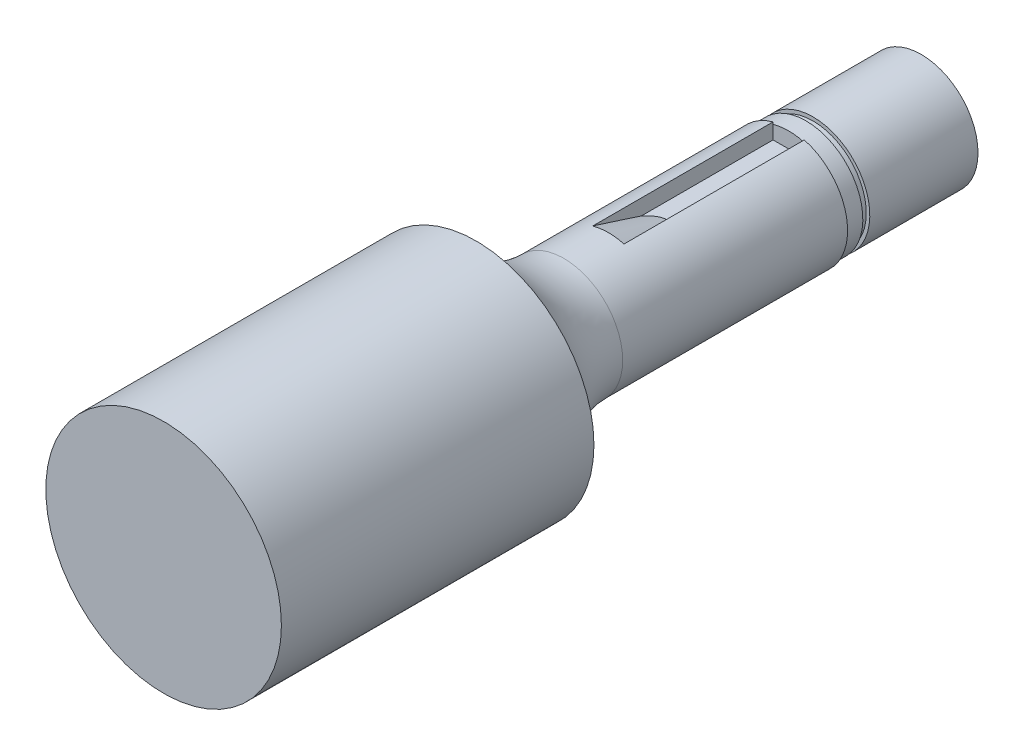
ISO-10303-21;
HEADER;
FILE_DESCRIPTION(('STEP AP214'),'2;1');
FILE_NAME('part.step','',(''),(''),'','','');
FILE_SCHEMA(('AUTOMOTIVE_DESIGN { 1 0 10303 214 1 1 1 1 }'));
ENDSEC;
DATA;
#1=APPLICATION_CONTEXT('core data for automotive mechanical design processes');
#2=APPLICATION_PROTOCOL_DEFINITION('international standard','automotive_design',2000,#1);
#3=PRODUCT_CONTEXT('',#1,'mechanical');
#4=PRODUCT('Part','Part','',(#3));
#5=PRODUCT_RELATED_PRODUCT_CATEGORY('part','',(#4));
#6=PRODUCT_DEFINITION_FORMATION('','',#4);
#7=PRODUCT_DEFINITION_CONTEXT('part definition',#1,'design');
#8=PRODUCT_DEFINITION('design','',#6,#7);
#9=PRODUCT_DEFINITION_SHAPE('','',#8);
#10=(LENGTH_UNIT() NAMED_UNIT(*) SI_UNIT(.MILLI.,.METRE.));
#11=(NAMED_UNIT(*) PLANE_ANGLE_UNIT() SI_UNIT($,.RADIAN.));
#12=(NAMED_UNIT(*) SI_UNIT($,.STERADIAN.) SOLID_ANGLE_UNIT());
#13=UNCERTAINTY_MEASURE_WITH_UNIT(LENGTH_MEASURE(1.E-05),#10,'distance_accuracy_value','');
#14=(GEOMETRIC_REPRESENTATION_CONTEXT(3) GLOBAL_UNCERTAINTY_ASSIGNED_CONTEXT((#13)) GLOBAL_UNIT_ASSIGNED_CONTEXT((#10,
#11,#12)) REPRESENTATION_CONTEXT('',''));
#15=CARTESIAN_POINT('',(0.,0.,0.));
#16=DIRECTION('',(0.,0.,1.));
#17=DIRECTION('',(1.,0.,0.));
#18=AXIS2_PLACEMENT_3D('',#15,#16,#17);
#19=CARTESIAN_POINT('',(0.,0.,33.02));
#20=DIRECTION('',(0.,0.,-1.));
#21=DIRECTION('',(-1.,0.,0.));
#22=AXIS2_PLACEMENT_3D('',#19,#20,#21);
#23=CYLINDRICAL_SURFACE('',#22,6.223);
#24=CARTESIAN_POINT('',(0.,0.,23.7607197363942));
#25=DIRECTION('',(0.,0.,1.));
#26=DIRECTION('',(1.,0.,0.));
#27=AXIS2_PLACEMENT_3D('',#24,#25,#26);
#28=CIRCLE('',#27,6.223);
#29=CARTESIAN_POINT('',(6.223,0.,23.7607197363942));
#30=VERTEX_POINT('',#29);
#31=EDGE_CURVE('E11',#30,#30,#28,.F.);
#32=ORIENTED_EDGE('',*,*,#31,.T.);
#33=EDGE_LOOP('',(#32));
#34=FACE_BOUND('',#33,.T.);
#35=DIRECTION('',(0.,0.,-1.));
#36=VECTOR('',#35,1.);
#37=CARTESIAN_POINT('',(1.651,5.999993999997,33.02));
#38=LINE('',#37,#36);
#39=CARTESIAN_POINT('',(1.651,5.999993999997,0.));
#40=VERTEX_POINT('',#39);
#41=CARTESIAN_POINT('',(1.651,5.999993999997,19.05));
#42=VERTEX_POINT('',#41);
#43=EDGE_CURVE('E119',#40,#42,#38,.F.);
#44=ORIENTED_EDGE('',*,*,#43,.T.);
#45=CARTESIAN_POINT('',(0.,0.,19.05));
#46=DIRECTION('',(0.,0.,-1.));
#47=DIRECTION('',(-1.,0.,0.));
#48=AXIS2_PLACEMENT_3D('',#45,#46,#47);
#49=CIRCLE('',#48,6.223);
#50=CARTESIAN_POINT('',(-1.651,5.999993999997,19.05));
#51=VERTEX_POINT('',#50);
#52=EDGE_CURVE('E94',#42,#51,#49,.F.);
#53=ORIENTED_EDGE('',*,*,#52,.T.);
#54=DIRECTION('',(0.,0.,-1.));
#55=VECTOR('',#54,1.);
#56=CARTESIAN_POINT('',(-1.651,5.999993999997,33.02));
#57=LINE('',#56,#55);
#58=CARTESIAN_POINT('',(-1.651,5.999993999997,0.));
#59=VERTEX_POINT('',#58);
#60=EDGE_CURVE('E116',#51,#59,#57,.T.);
#61=ORIENTED_EDGE('',*,*,#60,.T.);
#62=CARTESIAN_POINT('',(0.,0.,0.));
#63=DIRECTION('',(0.,0.,1.));
#64=DIRECTION('',(1.,0.,0.));
#65=AXIS2_PLACEMENT_3D('',#62,#63,#64);
#66=CIRCLE('',#65,6.223);
#67=EDGE_CURVE('E95',#59,#40,#66,.T.);
#68=ORIENTED_EDGE('',*,*,#67,.T.);
#69=EDGE_LOOP('',(#44,#53,#61,#68));
#70=FACE_BOUND('',#69,.T.);
#71=ADVANCED_FACE('F35',(#34,#70),#23,.T.);
#72=CARTESIAN_POINT('',(0.,0.,0.));
#73=DIRECTION('',(0.,0.,1.));
#74=DIRECTION('',(1.,0.,0.));
#75=AXIS2_PLACEMENT_3D('',#72,#73,#74);
#76=PLANE('',#75);
#77=DIRECTION('',(0.,1.,0.));
#78=VECTOR('',#77,1.);
#79=CARTESIAN_POINT('',(-1.651,7.650993999997,0.));
#80=LINE('',#79,#78);
#81=CARTESIAN_POINT('',(-1.651,5.76837923510582,0.));
#82=VERTEX_POINT('',#81);
#83=EDGE_CURVE('E104',#82,#59,#80,.T.);
#84=ORIENTED_EDGE('',*,*,#83,.F.);
#85=CARTESIAN_POINT('',(0.,0.,0.));
#86=DIRECTION('',(0.,0.,1.));
#87=DIRECTION('',(0.124481116014532,-0.992221977057441,0.));
#88=AXIS2_PLACEMENT_3D('',#85,#86,#87);
#89=CIRCLE('',#88,6.);
#90=CARTESIAN_POINT('',(1.651,5.76837923510582,0.));
#91=VERTEX_POINT('',#90);
#92=EDGE_CURVE('E84',#82,#91,#89,.T.);
#93=ORIENTED_EDGE('',*,*,#92,.T.);
#94=DIRECTION('',(0.,-1.,0.));
#95=VECTOR('',#94,1.);
#96=CARTESIAN_POINT('',(1.651,7.650993999997,0.));
#97=LINE('',#96,#95);
#98=EDGE_CURVE('E200',#40,#91,#97,.T.);
#99=ORIENTED_EDGE('',*,*,#98,.F.);
#100=ORIENTED_EDGE('',*,*,#67,.F.);
#101=EDGE_LOOP('',(#84,#93,#99,#100));
#102=FACE_BOUND('',#101,.T.);
#103=ADVANCED_FACE('F105',(#102),#76,.F.);
#104=CARTESIAN_POINT('',(0.,0.,66.04));
#105=DIRECTION('',(0.,0.,-1.));
#106=DIRECTION('',(-1.,0.,0.));
#107=AXIS2_PLACEMENT_3D('',#104,#105,#106);
#108=CYLINDRICAL_SURFACE('',#107,12.446);
#109=CARTESIAN_POINT('',(0.,0.,66.04));
#110=DIRECTION('',(0.,0.,1.));
#111=DIRECTION('',(1.,0.,0.));
#112=AXIS2_PLACEMENT_3D('',#109,#110,#111);
#113=CIRCLE('',#112,12.446);
#114=CARTESIAN_POINT('',(12.446,0.,66.04));
#115=VERTEX_POINT('',#114);
#116=EDGE_CURVE('E122',#115,#115,#113,.T.);
#117=ORIENTED_EDGE('',*,*,#116,.F.);
#118=EDGE_LOOP('',(#117));
#119=FACE_BOUND('',#118,.T.);
#120=CARTESIAN_POINT('',(0.,0.,33.02));
#121=DIRECTION('',(0.,0.,1.));
#122=DIRECTION('',(1.,0.,0.));
#123=AXIS2_PLACEMENT_3D('',#120,#121,#122);
#124=CIRCLE('',#123,12.446);
#125=CARTESIAN_POINT('',(12.446,0.,33.02));
#126=VERTEX_POINT('',#125);
#127=EDGE_CURVE('E121',#126,#126,#124,.T.);
#128=ORIENTED_EDGE('',*,*,#127,.T.);
#129=EDGE_LOOP('',(#128));
#130=FACE_BOUND('',#129,.T.);
#131=ADVANCED_FACE('F193',(#119,#130),#108,.T.);
#132=CARTESIAN_POINT('',(1.651,7.650993999997,12.7));
#133=DIRECTION('',(1.,0.,0.));
#134=DIRECTION('',(0.,0.,-1.));
#135=AXIS2_PLACEMENT_3D('',#132,#133,#134);
#136=PLANE('',#135);
#137=ORIENTED_EDGE('',*,*,#98,.T.);
#138=CARTESIAN_POINT('',(1.651,4.348993999997,0.));
#139=VERTEX_POINT('',#138);
#140=EDGE_CURVE('E101',#91,#139,#97,.T.);
#141=ORIENTED_EDGE('',*,*,#140,.T.);
#142=DIRECTION('',(0.,0.,-1.));
#143=VECTOR('',#142,1.);
#144=CARTESIAN_POINT('',(1.651,4.348993999997,12.7));
#145=LINE('',#144,#143);
#146=CARTESIAN_POINT('',(1.651,4.348993999997,13.9109441465152));
#147=VERTEX_POINT('',#146);
#148=EDGE_CURVE('E58',#147,#139,#145,.T.);
#149=ORIENTED_EDGE('',*,*,#148,.F.);
#150=CARTESIAN_POINT('',(1.651,4.348993999997,13.9109441465152));
#151=CARTESIAN_POINT('',(1.651,4.48878768448812,14.3384861432952));
#152=CARTESIAN_POINT('',(1.651,4.62785328900993,14.7662652337215));
#153=CARTESIAN_POINT('',(1.651,4.90480450015791,15.6222030603465));
#154=CARTESIAN_POINT('',(1.651,5.0426901125231,16.0503617946876));
#155=CARTESIAN_POINT('',(1.651,5.31755858795782,16.906967693413));
#156=CARTESIAN_POINT('',(1.651,5.45454145279133,17.3354148572319));
#157=CARTESIAN_POINT('',(1.651,5.72777481213549,18.1925449818668));
#158=CARTESIAN_POINT('',(1.651,5.86402530310477,18.621227943812));
#159=CARTESIAN_POINT('',(1.651,5.99999399999707,19.05));
#160=B_SPLINE_CURVE_WITH_KNOTS('',3,(#150,#151,#152,#153,#154,#155,#156,#157,#158,#159),
.UNSPECIFIED.,.F.,.F.,(4,2,2,2,4),(0.,1.34944603210449,2.69888549730226,4.04832232487302,
5.39776567172789),.UNSPECIFIED.);
#161=EDGE_CURVE('E137',#147,#42,#160,.T.);
#162=ORIENTED_EDGE('',*,*,#161,.T.);
#163=ORIENTED_EDGE('',*,*,#43,.F.);
#164=EDGE_LOOP('',(#137,#141,#149,#162,#163));
#165=FACE_BOUND('',#164,.T.);
#166=ADVANCED_FACE('F162',(#165),#136,.F.);
#167=CARTESIAN_POINT('',(-1.651,7.650993999997,12.7));
#168=DIRECTION('',(-1.,0.,0.));
#169=DIRECTION('',(0.,-1.,0.));
#170=AXIS2_PLACEMENT_3D('',#167,#168,#169);
#171=PLANE('',#170);
#172=ORIENTED_EDGE('',*,*,#60,.F.);
#173=CARTESIAN_POINT('',(-1.651,5.999993999997,19.05));
#174=CARTESIAN_POINT('',(-1.651,5.86402530310475,18.621227943812));
#175=CARTESIAN_POINT('',(-1.651,5.72777481213549,18.1925449818668));
#176=CARTESIAN_POINT('',(-1.651,5.45454145279134,17.3354148572319));
#177=CARTESIAN_POINT('',(-1.651,5.31755858795782,16.906967693413));
#178=CARTESIAN_POINT('',(-1.651,5.0426901125231,16.0503617946876));
#179=CARTESIAN_POINT('',(-1.651,4.90480450015791,15.6222030603465));
#180=CARTESIAN_POINT('',(-1.651,4.62785328900993,14.7662652337215));
#181=CARTESIAN_POINT('',(-1.651,4.48878768448813,14.3384861432952));
#182=CARTESIAN_POINT('',(-1.651,4.348993999997,13.9109441465152));
#183=B_SPLINE_CURVE_WITH_KNOTS('',3,(#173,#174,#175,#176,#177,#178,#179,#180,#181,#182),
.UNSPECIFIED.,.F.,.F.,(4,2,2,2,4),(0.,1.34944334685487,2.69888017442563,4.04831963962339,
5.39776567172789),.UNSPECIFIED.);
#184=CARTESIAN_POINT('',(-1.651,4.348993999997,13.9109441465152));
#185=VERTEX_POINT('',#184);
#186=EDGE_CURVE('E43',#51,#185,#183,.T.);
#187=ORIENTED_EDGE('',*,*,#186,.T.);
#188=DIRECTION('',(0.,0.,-1.));
#189=VECTOR('',#188,1.);
#190=CARTESIAN_POINT('',(-1.651,4.348993999997,12.7));
#191=LINE('',#190,#189);
#192=CARTESIAN_POINT('',(-1.651,4.348993999997,0.));
#193=VERTEX_POINT('',#192);
#194=EDGE_CURVE('E50',#185,#193,#191,.T.);
#195=ORIENTED_EDGE('',*,*,#194,.T.);
#196=EDGE_CURVE('E100',#193,#82,#80,.T.);
#197=ORIENTED_EDGE('',*,*,#196,.T.);
#198=ORIENTED_EDGE('',*,*,#83,.T.);
#199=EDGE_LOOP('',(#172,#187,#195,#197,#198));
#200=FACE_BOUND('',#199,.T.);
#201=ADVANCED_FACE('F111',(#200),#171,.F.);
#202=CARTESIAN_POINT('',(1.651,4.348993999997,12.7));
#203=DIRECTION('',(0.,-1.,0.));
#204=DIRECTION('',(1.,0.,0.));
#205=AXIS2_PLACEMENT_3D('',#202,#203,#204);
#206=PLANE('',#205);
#207=DIRECTION('',(-1.,0.,0.));
#208=VECTOR('',#207,1.);
#209=CARTESIAN_POINT('',(1.651,4.348993999997,0.));
#210=LINE('',#209,#208);
#211=EDGE_CURVE('E109',#139,#193,#210,.T.);
#212=ORIENTED_EDGE('',*,*,#211,.T.);
#213=ORIENTED_EDGE('',*,*,#194,.F.);
#214=CARTESIAN_POINT('',(-1.651,4.348993999997,13.9109441465152));
#215=CARTESIAN_POINT('',(-1.61005618872781,4.348993999997,13.8634272974747));
#216=CARTESIAN_POINT('',(-1.56836410959487,4.348993999997,13.8165582887386));
#217=CARTESIAN_POINT('',(-1.48322673799133,4.348993999997,13.7243626394037));
#218=CARTESIAN_POINT('',(-1.43977984637753,4.348993999997,13.6790374783294));
#219=CARTESIAN_POINT('',(-1.30452629215187,4.348993999997,13.543870052739));
#220=CARTESIAN_POINT('',(-1.20964096979234,4.348993999997,13.4570180673232));
#221=CARTESIAN_POINT('',(-1.00927266923083,4.348993999997,13.2949445900507));
#222=CARTESIAN_POINT('',(-0.903730972190333,4.348993999997,13.2197940685727));
#223=CARTESIAN_POINT('',(-0.681503187742133,4.348993999997,13.0896475755019));
#224=CARTESIAN_POINT('',(-0.564931867247685,4.348993999997,13.0344678156366));
#225=CARTESIAN_POINT('',(-0.369229233683072,4.348993999997,12.9695338077975));
#226=CARTESIAN_POINT('',(-0.293220374053448,4.348993999997,12.95045673981));
#227=CARTESIAN_POINT('',(-0.139043205256273,4.348993999997,12.9254592434777));
#228=CARTESIAN_POINT('',(-0.0608778557482803,4.348993999997,12.9195216107734));
#229=CARTESIAN_POINT('',(0.0517782545083004,4.348993999997,12.9209532088466));
#230=CARTESIAN_POINT('',(0.0864128917035788,4.348993999997,12.922763167982));
#231=CARTESIAN_POINT('',(0.155419094372631,4.348993999997,12.9290359683526));
#232=CARTESIAN_POINT('',(0.189790805941623,4.348993999997,12.9334972085648));
#233=CARTESIAN_POINT('',(0.325453308823906,4.348993999997,12.9563450626101));
#234=CARTESIAN_POINT('',(0.425161260717606,4.348993999997,12.9848499555557));
#235=CARTESIAN_POINT('',(0.617795877622099,4.348993999997,13.0597493757885));
#236=CARTESIAN_POINT('',(0.710680653530877,4.348993999997,13.1062449395608));
#237=CARTESIAN_POINT('',(0.937966610244844,4.348993999997,13.2406669883374));
#238=CARTESIAN_POINT('',(1.06709253530649,4.348993999997,13.3373137076738));
#239=CARTESIAN_POINT('',(1.31046762868501,4.348993999997,13.547204462987));
#240=CARTESIAN_POINT('',(1.42469917345692,4.348993999997,13.6604678297207));
#241=CARTESIAN_POINT('',(1.55336440303727,4.348993999997,13.8004306161889));
#242=CARTESIAN_POINT('',(1.57316875795473,4.348993999997,13.8223461472048));
#243=CARTESIAN_POINT('',(1.61237096339529,4.348993999997,13.8664398477914));
#244=CARTESIAN_POINT('',(1.6317697068805,4.348993999997,13.8886172232144));
#245=CARTESIAN_POINT('',(1.65100000000007,4.348993999997,13.9109441465152));
#246=B_SPLINE_CURVE_WITH_KNOTS('',3,(#214,#215,#216,#217,#218,#219,#220,#221,#222,#223,#224,
#225,#226,#227,#228,#229,#230,#231,#232,#233,#234,#235,#236,#237,#238,#239,#240,#241,#242,#243,
#244,#245),.UNSPECIFIED.,.F.,.F.,(4,2,2,2,2,2,2,2,2,2,2,2,2,2,2,4),(0.,0.188151120985542,
0.376477751888457,0.761659868508651,1.14909407303352,1.53286621972931,1.76701346073699,
2.00085393492138,2.10481187527057,2.20870710246953,2.5173066354491,2.82766503982231,
3.30878007454317,3.79045931270973,3.87907370203482,3.9674664175143),.UNSPECIFIED.);
#247=EDGE_CURVE('E130',#185,#147,#246,.T.);
#248=ORIENTED_EDGE('',*,*,#247,.T.);
#249=ORIENTED_EDGE('',*,*,#148,.T.);
#250=EDGE_LOOP('',(#212,#213,#248,#249));
#251=FACE_BOUND('',#250,.T.);
#252=ADVANCED_FACE('F143',(#251),#206,.F.);
#253=CARTESIAN_POINT('',(0.,0.,0.));
#254=DIRECTION('',(0.,0.,1.));
#255=DIRECTION('',(0.124481116014532,-0.992221977057441,0.));
#256=AXIS2_PLACEMENT_3D('',#253,#254,#255);
#257=PLANE('',#256);
#258=ORIENTED_EDGE('',*,*,#140,.F.);
#259=EDGE_CURVE('E88',#91,#82,#89,.T.);
#260=ORIENTED_EDGE('',*,*,#259,.T.);
#261=ORIENTED_EDGE('',*,*,#196,.F.);
#262=ORIENTED_EDGE('',*,*,#211,.F.);
#263=EDGE_LOOP('',(#258,#260,#261,#262));
#264=FACE_BOUND('',#263,.T.);
#265=ADVANCED_FACE('F98',(#264),#257,.T.);
#266=CARTESIAN_POINT('',(0.,0.,0.));
#267=DIRECTION('',(0.,0.,-1.));
#268=DIRECTION('',(-0.124481116014532,0.992221977057441,0.));
#269=AXIS2_PLACEMENT_3D('',#266,#267,#268);
#270=CYLINDRICAL_SURFACE('',#269,6.);
#271=ORIENTED_EDGE('',*,*,#259,.F.);
#272=ORIENTED_EDGE('',*,*,#92,.F.);
#273=EDGE_LOOP('',(#271,#272));
#274=FACE_BOUND('',#273,.T.);
#275=CARTESIAN_POINT('',(0.,0.,-1.8334));
#276=DIRECTION('',(0.,0.,-1.));
#277=DIRECTION('',(-0.124481116014532,0.992221977057441,0.));
#278=AXIS2_PLACEMENT_3D('',#275,#276,#277);
#279=CIRCLE('',#278,6.);
#280=CARTESIAN_POINT('',(-0.746886696087194,5.95333186234465,-1.8334));
#281=VERTEX_POINT('',#280);
#282=EDGE_CURVE('E202',#281,#281,#279,.T.);
#283=ORIENTED_EDGE('',*,*,#282,.F.);
#284=EDGE_LOOP('',(#283));
#285=FACE_BOUND('',#284,.T.);
#286=ADVANCED_FACE('F86',(#274,#285),#270,.T.);
#287=CARTESIAN_POINT('',(0.,0.,-1.8334));
#288=DIRECTION('',(0.,0.,-1.));
#289=DIRECTION('',(-0.124481116014532,0.992221977057441,0.));
#290=AXIS2_PLACEMENT_3D('',#287,#288,#289);
#291=PLANE('',#290);
#292=CARTESIAN_POINT('',(0.,0.,-1.8334));
#293=DIRECTION('',(0.,0.,-1.));
#294=DIRECTION('',(-0.124481116014532,0.992221977057441,0.));
#295=AXIS2_PLACEMENT_3D('',#292,#293,#294);
#296=CIRCLE('',#295,5.6261);
#297=CARTESIAN_POINT('',(-0.700343206809361,5.58234006512287,-1.8334));
#298=VERTEX_POINT('',#297);
#299=EDGE_CURVE('E208',#298,#298,#296,.T.);
#300=ORIENTED_EDGE('',*,*,#299,.F.);
#301=EDGE_LOOP('',(#300));
#302=FACE_BOUND('',#301,.T.);
#303=ORIENTED_EDGE('',*,*,#282,.T.);
#304=EDGE_LOOP('',(#303));
#305=FACE_BOUND('',#304,.T.);
#306=ADVANCED_FACE('F176',(#302,#305),#291,.T.);
#307=CARTESIAN_POINT('',(0.,0.,-2.57));
#308=DIRECTION('',(0.,0.,-1.));
#309=DIRECTION('',(-0.124481116014532,0.992221977057441,0.));
#310=AXIS2_PLACEMENT_3D('',#307,#308,#309);
#311=PLANE('',#310);
#312=CARTESIAN_POINT('',(0.,0.,-2.57));
#313=DIRECTION('',(0.,0.,-1.));
#314=DIRECTION('',(-0.124481116014532,0.992221977057441,0.));
#315=AXIS2_PLACEMENT_3D('',#312,#313,#314);
#316=CIRCLE('',#315,5.6261);
#317=CARTESIAN_POINT('',(-0.700343206809361,5.58234006512287,-2.57));
#318=VERTEX_POINT('',#317);
#319=EDGE_CURVE('E211',#318,#318,#316,.T.);
#320=ORIENTED_EDGE('',*,*,#319,.T.);
#321=EDGE_LOOP('',(#320));
#322=FACE_BOUND('',#321,.T.);
#323=CARTESIAN_POINT('',(0.,0.,-2.57));
#324=DIRECTION('',(0.,0.,-1.));
#325=DIRECTION('',(-0.124481116014532,0.992221977057441,0.));
#326=AXIS2_PLACEMENT_3D('',#323,#324,#325);
#327=CIRCLE('',#326,6.);
#328=CARTESIAN_POINT('',(-0.746886696087194,5.95333186234465,-2.57));
#329=VERTEX_POINT('',#328);
#330=EDGE_CURVE('E205',#329,#329,#327,.T.);
#331=ORIENTED_EDGE('',*,*,#330,.F.);
#332=EDGE_LOOP('',(#331));
#333=FACE_BOUND('',#332,.T.);
#334=ADVANCED_FACE('F173',(#322,#333),#311,.F.);
#335=CARTESIAN_POINT('',(0.,0.,-1.8334));
#336=DIRECTION('',(0.,0.,-1.));
#337=DIRECTION('',(-0.124481116014532,0.992221977057441,0.));
#338=AXIS2_PLACEMENT_3D('',#335,#336,#337);
#339=CYLINDRICAL_SURFACE('',#338,5.6261);
#340=ORIENTED_EDGE('',*,*,#299,.T.);
#341=EDGE_LOOP('',(#340));
#342=FACE_BOUND('',#341,.T.);
#343=ORIENTED_EDGE('',*,*,#319,.F.);
#344=EDGE_LOOP('',(#343));
#345=FACE_BOUND('',#344,.T.);
#346=ADVANCED_FACE('F169',(#342,#345),#339,.T.);
#347=CARTESIAN_POINT('',(0.,0.,-14.));
#348=DIRECTION('',(0.,0.,1.));
#349=DIRECTION('',(0.124481116014532,-0.992221977057441,0.));
#350=AXIS2_PLACEMENT_3D('',#347,#348,#349);
#351=PLANE('',#350);
#352=CARTESIAN_POINT('',(0.,0.,-14.));
#353=DIRECTION('',(0.,0.,1.));
#354=DIRECTION('',(0.124481116014532,-0.992221977057441,0.));
#355=AXIS2_PLACEMENT_3D('',#352,#353,#354);
#356=CIRCLE('',#355,6.);
#357=CARTESIAN_POINT('',(0.746886696087195,-5.95333186234465,-14.));
#358=VERTEX_POINT('',#357);
#359=EDGE_CURVE('E102',#358,#358,#356,.T.);
#360=ORIENTED_EDGE('',*,*,#359,.F.);
#361=EDGE_LOOP('',(#360));
#362=FACE_BOUND('',#361,.T.);
#363=ADVANCED_FACE('F165',(#362),#351,.F.);
#364=ORIENTED_EDGE('',*,*,#330,.T.);
#365=EDGE_LOOP('',(#364));
#366=FACE_BOUND('',#365,.T.);
#367=ORIENTED_EDGE('',*,*,#359,.T.);
#368=EDGE_LOOP('',(#367));
#369=FACE_BOUND('',#368,.T.);
#370=ADVANCED_FACE('F150',(#366,#369),#270,.T.);
#371=CARTESIAN_POINT('',(0.,0.,12.7));
#372=DIRECTION('',(0.,0.,1.));
#373=DIRECTION('',(1.,0.,0.));
#374=AXIS2_PLACEMENT_3D('',#371,#372,#373);
#375=CONICAL_SURFACE('',#374,4.28161017273745,0.296705972839044);
#376=ORIENTED_EDGE('',*,*,#186,.F.);
#377=ORIENTED_EDGE('',*,*,#52,.F.);
#378=ORIENTED_EDGE('',*,*,#161,.F.);
#379=ORIENTED_EDGE('',*,*,#247,.F.);
#380=EDGE_LOOP('',(#376,#377,#378,#379));
#381=FACE_BOUND('',#380,.T.);
#382=ADVANCED_FACE('F146',(#381),#375,.T.);
#383=CARTESIAN_POINT('',(0.,0.,23.7607197363942));
#384=DIRECTION('',(0.,0.,1.));
#385=DIRECTION('',(1.,0.,0.));
#386=AXIS2_PLACEMENT_3D('',#383,#384,#385);
#387=TOROIDAL_SURFACE('',#386,16.223,10.);
#388=ORIENTED_EDGE('',*,*,#31,.F.);
#389=EDGE_LOOP('',(#388));
#390=FACE_BOUND('',#389,.T.);
#391=ORIENTED_EDGE('',*,*,#127,.F.);
#392=EDGE_LOOP('',(#391));
#393=FACE_BOUND('',#392,.T.);
#394=ADVANCED_FACE('F37',(#390,#393),#387,.F.);
#395=CARTESIAN_POINT('',(0.,0.,66.04));
#396=DIRECTION('',(0.,0.,1.));
#397=DIRECTION('',(1.,0.,0.));
#398=AXIS2_PLACEMENT_3D('',#395,#396,#397);
#399=PLANE('',#398);
#400=ORIENTED_EDGE('',*,*,#116,.T.);
#401=EDGE_LOOP('',(#400));
#402=FACE_BOUND('',#401,.T.);
#403=ADVANCED_FACE('F269',(#402),#399,.T.);
#404=CLOSED_SHELL('',(#71,#103,#131,#166,#201,#252,#265,#286,#306,#334,#346,#363,#370,#382,#394,#403));
#405=MANIFOLD_SOLID_BREP('B2',#404);
#406=ADVANCED_BREP_SHAPE_REPRESENTATION('',(#18,#405),#14);
#407=SHAPE_DEFINITION_REPRESENTATION(#9,#406);
ENDSEC;
END-ISO-10303-21;
